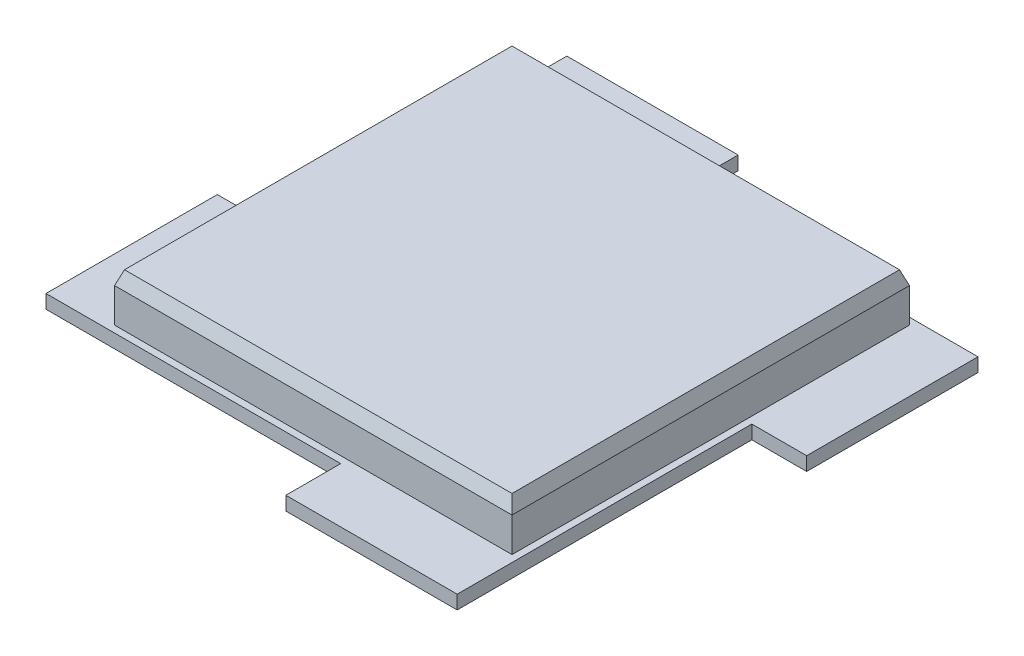
ISO-10303-21;
HEADER;
FILE_DESCRIPTION(('STEP AP214'),'2;1');
FILE_NAME('part.step','',(''),(''),'','','');
FILE_SCHEMA(('AUTOMOTIVE_DESIGN { 1 0 10303 214 1 1 1 1 }'));
ENDSEC;
DATA;
#1=APPLICATION_CONTEXT('core data for automotive mechanical design processes');
#2=APPLICATION_PROTOCOL_DEFINITION('international standard','automotive_design',2000,#1);
#3=PRODUCT_CONTEXT('',#1,'mechanical');
#4=PRODUCT('Part','Part','',(#3));
#5=PRODUCT_RELATED_PRODUCT_CATEGORY('part','',(#4));
#6=PRODUCT_DEFINITION_FORMATION('','',#4);
#7=PRODUCT_DEFINITION_CONTEXT('part definition',#1,'design');
#8=PRODUCT_DEFINITION('design','',#6,#7);
#9=PRODUCT_DEFINITION_SHAPE('','',#8);
#10=(LENGTH_UNIT() NAMED_UNIT(*) SI_UNIT(.MILLI.,.METRE.));
#11=(NAMED_UNIT(*) PLANE_ANGLE_UNIT() SI_UNIT($,.RADIAN.));
#12=(NAMED_UNIT(*) SI_UNIT($,.STERADIAN.) SOLID_ANGLE_UNIT());
#13=UNCERTAINTY_MEASURE_WITH_UNIT(LENGTH_MEASURE(1.E-05),#10,'distance_accuracy_value','');
#14=(GEOMETRIC_REPRESENTATION_CONTEXT(3) GLOBAL_UNCERTAINTY_ASSIGNED_CONTEXT((#13)) GLOBAL_UNIT_ASSIGNED_CONTEXT((#10,
#11,#12)) REPRESENTATION_CONTEXT('',''));
#15=CARTESIAN_POINT('',(0.,0.,0.));
#16=DIRECTION('',(0.,0.,1.));
#17=DIRECTION('',(1.,0.,0.));
#18=AXIS2_PLACEMENT_3D('',#15,#16,#17);
#19=CARTESIAN_POINT('',(0.,2.,0.));
#20=DIRECTION('',(0.,1.,0.));
#21=DIRECTION('',(0.,0.,1.));
#22=AXIS2_PLACEMENT_3D('',#19,#20,#21);
#23=PLANE('',#22);
#24=DIRECTION('',(-1.,0.,0.));
#25=VECTOR('',#24,1.);
#26=CARTESIAN_POINT('',(0.,2.,-8.));
#27=LINE('',#26,#25);
#28=CARTESIAN_POINT('',(43.,2.,-8.));
#29=VERTEX_POINT('',#28);
#30=CARTESIAN_POINT('',(0.,2.,-8.));
#31=VERTEX_POINT('',#30);
#32=EDGE_CURVE('E192',#29,#31,#27,.T.);
#33=ORIENTED_EDGE('',*,*,#32,.F.);
#34=DIRECTION('',(0.,0.,1.));
#35=VECTOR('',#34,1.);
#36=CARTESIAN_POINT('',(43.,2.,0.));
#37=LINE('',#36,#35);
#38=CARTESIAN_POINT('',(43.,2.,0.));
#39=VERTEX_POINT('',#38);
#40=EDGE_CURVE('E259',#29,#39,#37,.T.);
#41=ORIENTED_EDGE('',*,*,#40,.T.);
#42=DIRECTION('',(1.,0.,0.));
#43=VECTOR('',#42,1.);
#44=CARTESIAN_POINT('',(0.,2.,0.));
#45=LINE('',#44,#43);
#46=CARTESIAN_POINT('',(68.,2.,0.));
#47=VERTEX_POINT('',#46);
#48=EDGE_CURVE('E220',#39,#47,#45,.T.);
#49=ORIENTED_EDGE('',*,*,#48,.T.);
#50=DIRECTION('',(0.,0.,-1.));
#51=VECTOR('',#50,1.);
#52=CARTESIAN_POINT('',(68.,2.,0.));
#53=LINE('',#52,#51);
#54=CARTESIAN_POINT('',(68.,2.,-43.));
#55=VERTEX_POINT('',#54);
#56=EDGE_CURVE('E239',#47,#55,#53,.T.);
#57=ORIENTED_EDGE('',*,*,#56,.T.);
#58=DIRECTION('',(1.,0.,0.));
#59=VECTOR('',#58,1.);
#60=CARTESIAN_POINT('',(0.,2.,-43.));
#61=LINE('',#60,#59);
#62=CARTESIAN_POINT('',(76.,2.,-43.));
#63=VERTEX_POINT('',#62);
#64=EDGE_CURVE('E236',#55,#63,#61,.T.);
#65=ORIENTED_EDGE('',*,*,#64,.T.);
#66=DIRECTION('',(0.,0.,-1.));
#67=VECTOR('',#66,1.);
#68=CARTESIAN_POINT('',(76.,2.,0.));
#69=LINE('',#68,#67);
#70=CARTESIAN_POINT('',(76.,2.,-68.));
#71=VERTEX_POINT('',#70);
#72=EDGE_CURVE('E238',#63,#71,#69,.T.);
#73=ORIENTED_EDGE('',*,*,#72,.T.);
#74=DIRECTION('',(-1.,0.,0.));
#75=VECTOR('',#74,1.);
#76=CARTESIAN_POINT('',(0.,2.,-68.));
#77=LINE('',#76,#75);
#78=CARTESIAN_POINT('',(33.,2.,-68.));
#79=VERTEX_POINT('',#78);
#80=EDGE_CURVE('E241',#71,#79,#77,.T.);
#81=ORIENTED_EDGE('',*,*,#80,.T.);
#82=DIRECTION('',(0.,0.,-1.));
#83=VECTOR('',#82,1.);
#84=CARTESIAN_POINT('',(33.,2.,0.));
#85=LINE('',#84,#83);
#86=CARTESIAN_POINT('',(33.,2.,-76.));
#87=VERTEX_POINT('',#86);
#88=EDGE_CURVE('E247',#79,#87,#85,.T.);
#89=ORIENTED_EDGE('',*,*,#88,.T.);
#90=DIRECTION('',(-1.,0.,0.));
#91=VECTOR('',#90,1.);
#92=CARTESIAN_POINT('',(0.,2.,-76.));
#93=LINE('',#92,#91);
#94=CARTESIAN_POINT('',(8.,2.,-76.));
#95=VERTEX_POINT('',#94);
#96=EDGE_CURVE('E145',#87,#95,#93,.T.);
#97=ORIENTED_EDGE('',*,*,#96,.T.);
#98=DIRECTION('',(0.,0.,1.));
#99=VECTOR('',#98,1.);
#100=CARTESIAN_POINT('',(8.00000000000001,2.,0.));
#101=LINE('',#100,#99);
#102=CARTESIAN_POINT('',(8.00000000000001,2.,-33.));
#103=VERTEX_POINT('',#102);
#104=EDGE_CURVE('E136',#95,#103,#101,.T.);
#105=ORIENTED_EDGE('',*,*,#104,.T.);
#106=DIRECTION('',(-1.,0.,0.));
#107=VECTOR('',#106,1.);
#108=CARTESIAN_POINT('',(0.,2.,-33.));
#109=LINE('',#108,#107);
#110=CARTESIAN_POINT('',(0.,2.,-33.));
#111=VERTEX_POINT('',#110);
#112=EDGE_CURVE('E142',#103,#111,#109,.T.);
#113=ORIENTED_EDGE('',*,*,#112,.T.);
#114=DIRECTION('',(0.,0.,-1.));
#115=VECTOR('',#114,1.);
#116=CARTESIAN_POINT('',(0.,2.,0.));
#117=LINE('',#116,#115);
#118=EDGE_CURVE('E162',#31,#111,#117,.T.);
#119=ORIENTED_EDGE('',*,*,#118,.F.);
#120=EDGE_LOOP('',(#33,#41,#49,#57,#65,#73,#81,#89,#97,#105,#113,#119));
#121=FACE_BOUND('',#120,.T.);
#122=DIRECTION('',(0.,0.,1.));
#123=VECTOR('',#122,1.);
#124=CARTESIAN_POINT('',(9.,2.,-67.));
#125=LINE('',#124,#123);
#126=CARTESIAN_POINT('',(9.,2.,-67.));
#127=VERTEX_POINT('',#126);
#128=CARTESIAN_POINT('',(9.00000000000001,2.,-9.));
#129=VERTEX_POINT('',#128);
#130=EDGE_CURVE('E278',#127,#129,#125,.T.);
#131=ORIENTED_EDGE('',*,*,#130,.F.);
#132=DIRECTION('',(-1.,0.,0.));
#133=VECTOR('',#132,1.);
#134=CARTESIAN_POINT('',(67.,2.,-67.));
#135=LINE('',#134,#133);
#136=CARTESIAN_POINT('',(67.,2.,-67.));
#137=VERTEX_POINT('',#136);
#138=EDGE_CURVE('E281',#137,#127,#135,.T.);
#139=ORIENTED_EDGE('',*,*,#138,.F.);
#140=DIRECTION('',(0.,0.,-1.));
#141=VECTOR('',#140,1.);
#142=CARTESIAN_POINT('',(67.,2.,-67.));
#143=LINE('',#142,#141);
#144=CARTESIAN_POINT('',(67.,2.,-9.));
#145=VERTEX_POINT('',#144);
#146=EDGE_CURVE('E273',#145,#137,#143,.T.);
#147=ORIENTED_EDGE('',*,*,#146,.F.);
#148=DIRECTION('',(1.,0.,0.));
#149=VECTOR('',#148,1.);
#150=CARTESIAN_POINT('',(9.00000000000001,2.,-9.));
#151=LINE('',#150,#149);
#152=EDGE_CURVE('E276',#129,#145,#151,.T.);
#153=ORIENTED_EDGE('',*,*,#152,.F.);
#154=EDGE_LOOP('',(#131,#139,#147,#153));
#155=FACE_BOUND('',#154,.T.);
#156=ADVANCED_FACE('F35',(#121,#155),#23,.T.);
#157=CARTESIAN_POINT('',(0.,2.,-8.));
#158=DIRECTION('',(0.,0.,1.));
#159=DIRECTION('',(1.,0.,0.));
#160=AXIS2_PLACEMENT_3D('',#157,#158,#159);
#161=PLANE('',#160);
#162=DIRECTION('',(-1.,0.,0.));
#163=VECTOR('',#162,1.);
#164=CARTESIAN_POINT('',(0.,0.,-8.));
#165=LINE('',#164,#163);
#166=CARTESIAN_POINT('',(43.,0.,-8.));
#167=VERTEX_POINT('',#166);
#168=CARTESIAN_POINT('',(0.,0.,-8.));
#169=VERTEX_POINT('',#168);
#170=EDGE_CURVE('E167',#167,#169,#165,.T.);
#171=ORIENTED_EDGE('',*,*,#170,.F.);
#172=DIRECTION('',(0.,-1.,0.));
#173=VECTOR('',#172,1.);
#174=CARTESIAN_POINT('',(43.,2.,-8.));
#175=LINE('',#174,#173);
#176=EDGE_CURVE('E11',#29,#167,#175,.T.);
#177=ORIENTED_EDGE('',*,*,#176,.F.);
#178=ORIENTED_EDGE('',*,*,#32,.T.);
#179=DIRECTION('',(0.,-1.,0.));
#180=VECTOR('',#179,1.);
#181=CARTESIAN_POINT('',(0.,2.,-8.));
#182=LINE('',#181,#180);
#183=EDGE_CURVE('E59',#31,#169,#182,.T.);
#184=ORIENTED_EDGE('',*,*,#183,.T.);
#185=EDGE_LOOP('',(#171,#177,#178,#184));
#186=FACE_BOUND('',#185,.T.);
#187=ADVANCED_FACE('F37',(#186),#161,.T.);
#188=CARTESIAN_POINT('',(43.,2.,0.));
#189=DIRECTION('',(1.,0.,0.));
#190=DIRECTION('',(0.,0.,-1.));
#191=AXIS2_PLACEMENT_3D('',#188,#189,#190);
#192=PLANE('',#191);
#193=DIRECTION('',(0.,0.,1.));
#194=VECTOR('',#193,1.);
#195=CARTESIAN_POINT('',(43.,0.,0.));
#196=LINE('',#195,#194);
#197=CARTESIAN_POINT('',(43.,0.,0.));
#198=VERTEX_POINT('',#197);
#199=EDGE_CURVE('E169',#167,#198,#196,.T.);
#200=ORIENTED_EDGE('',*,*,#199,.T.);
#201=DIRECTION('',(0.,-1.,0.));
#202=VECTOR('',#201,1.);
#203=CARTESIAN_POINT('',(43.,2.,0.));
#204=LINE('',#203,#202);
#205=EDGE_CURVE('E43',#39,#198,#204,.T.);
#206=ORIENTED_EDGE('',*,*,#205,.F.);
#207=ORIENTED_EDGE('',*,*,#40,.F.);
#208=ORIENTED_EDGE('',*,*,#176,.T.);
#209=EDGE_LOOP('',(#200,#206,#207,#208));
#210=FACE_BOUND('',#209,.T.);
#211=ADVANCED_FACE('F376',(#210),#192,.F.);
#212=CARTESIAN_POINT('',(0.,2.,0.));
#213=DIRECTION('',(0.,0.,-1.));
#214=DIRECTION('',(-1.,0.,0.));
#215=AXIS2_PLACEMENT_3D('',#212,#213,#214);
#216=PLANE('',#215);
#217=DIRECTION('',(1.,0.,0.));
#218=VECTOR('',#217,1.);
#219=CARTESIAN_POINT('',(0.,0.,0.));
#220=LINE('',#219,#218);
#221=CARTESIAN_POINT('',(68.,0.,0.));
#222=VERTEX_POINT('',#221);
#223=EDGE_CURVE('E172',#198,#222,#220,.T.);
#224=ORIENTED_EDGE('',*,*,#223,.T.);
#225=DIRECTION('',(0.,-1.,0.));
#226=VECTOR('',#225,1.);
#227=CARTESIAN_POINT('',(68.,2.,0.));
#228=LINE('',#227,#226);
#229=EDGE_CURVE('E211',#47,#222,#228,.T.);
#230=ORIENTED_EDGE('',*,*,#229,.F.);
#231=ORIENTED_EDGE('',*,*,#48,.F.);
#232=ORIENTED_EDGE('',*,*,#205,.T.);
#233=EDGE_LOOP('',(#224,#230,#231,#232));
#234=FACE_BOUND('',#233,.T.);
#235=ADVANCED_FACE('F218',(#234),#216,.F.);
#236=CARTESIAN_POINT('',(68.,2.,0.));
#237=DIRECTION('',(-1.,0.,0.));
#238=DIRECTION('',(0.,0.,1.));
#239=AXIS2_PLACEMENT_3D('',#236,#237,#238);
#240=PLANE('',#239);
#241=DIRECTION('',(0.,0.,-1.));
#242=VECTOR('',#241,1.);
#243=CARTESIAN_POINT('',(68.,0.,0.));
#244=LINE('',#243,#242);
#245=CARTESIAN_POINT('',(68.,0.,-43.));
#246=VERTEX_POINT('',#245);
#247=EDGE_CURVE('E174',#222,#246,#244,.T.);
#248=ORIENTED_EDGE('',*,*,#247,.T.);
#249=DIRECTION('',(0.,-1.,0.));
#250=VECTOR('',#249,1.);
#251=CARTESIAN_POINT('',(68.,2.,-43.));
#252=LINE('',#251,#250);
#253=EDGE_CURVE('E208',#55,#246,#252,.T.);
#254=ORIENTED_EDGE('',*,*,#253,.F.);
#255=ORIENTED_EDGE('',*,*,#56,.F.);
#256=ORIENTED_EDGE('',*,*,#229,.T.);
#257=EDGE_LOOP('',(#248,#254,#255,#256));
#258=FACE_BOUND('',#257,.T.);
#259=ADVANCED_FACE('F230',(#258),#240,.F.);
#260=CARTESIAN_POINT('',(0.,2.,-43.));
#261=DIRECTION('',(0.,0.,-1.));
#262=DIRECTION('',(-1.,0.,0.));
#263=AXIS2_PLACEMENT_3D('',#260,#261,#262);
#264=PLANE('',#263);
#265=DIRECTION('',(1.,0.,0.));
#266=VECTOR('',#265,1.);
#267=CARTESIAN_POINT('',(0.,0.,-43.));
#268=LINE('',#267,#266);
#269=CARTESIAN_POINT('',(76.,0.,-43.));
#270=VERTEX_POINT('',#269);
#271=EDGE_CURVE('E176',#246,#270,#268,.T.);
#272=ORIENTED_EDGE('',*,*,#271,.T.);
#273=DIRECTION('',(0.,-1.,0.));
#274=VECTOR('',#273,1.);
#275=CARTESIAN_POINT('',(76.,2.,-43.));
#276=LINE('',#275,#274);
#277=EDGE_CURVE('E205',#63,#270,#276,.T.);
#278=ORIENTED_EDGE('',*,*,#277,.F.);
#279=ORIENTED_EDGE('',*,*,#64,.F.);
#280=ORIENTED_EDGE('',*,*,#253,.T.);
#281=EDGE_LOOP('',(#272,#278,#279,#280));
#282=FACE_BOUND('',#281,.T.);
#283=ADVANCED_FACE('F234',(#282),#264,.F.);
#284=CARTESIAN_POINT('',(76.,2.,0.));
#285=DIRECTION('',(-1.,0.,0.));
#286=DIRECTION('',(0.,0.,1.));
#287=AXIS2_PLACEMENT_3D('',#284,#285,#286);
#288=PLANE('',#287);
#289=DIRECTION('',(0.,0.,-1.));
#290=VECTOR('',#289,1.);
#291=CARTESIAN_POINT('',(76.,0.,0.));
#292=LINE('',#291,#290);
#293=CARTESIAN_POINT('',(76.,0.,-68.));
#294=VERTEX_POINT('',#293);
#295=EDGE_CURVE('E178',#270,#294,#292,.T.);
#296=ORIENTED_EDGE('',*,*,#295,.T.);
#297=DIRECTION('',(0.,-1.,0.));
#298=VECTOR('',#297,1.);
#299=CARTESIAN_POINT('',(76.,2.,-68.));
#300=LINE('',#299,#298);
#301=EDGE_CURVE('E202',#71,#294,#300,.T.);
#302=ORIENTED_EDGE('',*,*,#301,.F.);
#303=ORIENTED_EDGE('',*,*,#72,.F.);
#304=ORIENTED_EDGE('',*,*,#277,.T.);
#305=EDGE_LOOP('',(#296,#302,#303,#304));
#306=FACE_BOUND('',#305,.T.);
#307=ADVANCED_FACE('F394',(#306),#288,.F.);
#308=CARTESIAN_POINT('',(0.,2.,-68.));
#309=DIRECTION('',(0.,0.,1.));
#310=DIRECTION('',(1.,0.,0.));
#311=AXIS2_PLACEMENT_3D('',#308,#309,#310);
#312=PLANE('',#311);
#313=DIRECTION('',(-1.,0.,0.));
#314=VECTOR('',#313,1.);
#315=CARTESIAN_POINT('',(0.,0.,-68.));
#316=LINE('',#315,#314);
#317=CARTESIAN_POINT('',(33.,0.,-68.));
#318=VERTEX_POINT('',#317);
#319=EDGE_CURVE('E180',#294,#318,#316,.T.);
#320=ORIENTED_EDGE('',*,*,#319,.T.);
#321=DIRECTION('',(0.,-1.,0.));
#322=VECTOR('',#321,1.);
#323=CARTESIAN_POINT('',(33.,2.,-68.));
#324=LINE('',#323,#322);
#325=EDGE_CURVE('E199',#79,#318,#324,.T.);
#326=ORIENTED_EDGE('',*,*,#325,.F.);
#327=ORIENTED_EDGE('',*,*,#80,.F.);
#328=ORIENTED_EDGE('',*,*,#301,.T.);
#329=EDGE_LOOP('',(#320,#326,#327,#328));
#330=FACE_BOUND('',#329,.T.);
#331=ADVANCED_FACE('F391',(#330),#312,.F.);
#332=CARTESIAN_POINT('',(33.,2.,0.));
#333=DIRECTION('',(-1.,0.,0.));
#334=DIRECTION('',(0.,0.,1.));
#335=AXIS2_PLACEMENT_3D('',#332,#333,#334);
#336=PLANE('',#335);
#337=DIRECTION('',(0.,0.,-1.));
#338=VECTOR('',#337,1.);
#339=CARTESIAN_POINT('',(33.,0.,0.));
#340=LINE('',#339,#338);
#341=CARTESIAN_POINT('',(33.,0.,-76.));
#342=VERTEX_POINT('',#341);
#343=EDGE_CURVE('E182',#318,#342,#340,.T.);
#344=ORIENTED_EDGE('',*,*,#343,.T.);
#345=DIRECTION('',(0.,-1.,0.));
#346=VECTOR('',#345,1.);
#347=CARTESIAN_POINT('',(33.,2.,-76.));
#348=LINE('',#347,#346);
#349=EDGE_CURVE('E196',#87,#342,#348,.T.);
#350=ORIENTED_EDGE('',*,*,#349,.F.);
#351=ORIENTED_EDGE('',*,*,#88,.F.);
#352=ORIENTED_EDGE('',*,*,#325,.T.);
#353=EDGE_LOOP('',(#344,#350,#351,#352));
#354=FACE_BOUND('',#353,.T.);
#355=ADVANCED_FACE('F253',(#354),#336,.F.);
#356=CARTESIAN_POINT('',(0.,2.,-76.));
#357=DIRECTION('',(0.,0.,1.));
#358=DIRECTION('',(1.,0.,0.));
#359=AXIS2_PLACEMENT_3D('',#356,#357,#358);
#360=PLANE('',#359);
#361=DIRECTION('',(-1.,0.,0.));
#362=VECTOR('',#361,1.);
#363=CARTESIAN_POINT('',(0.,0.,-76.));
#364=LINE('',#363,#362);
#365=CARTESIAN_POINT('',(8.,0.,-76.));
#366=VERTEX_POINT('',#365);
#367=EDGE_CURVE('E184',#342,#366,#364,.T.);
#368=ORIENTED_EDGE('',*,*,#367,.T.);
#369=DIRECTION('',(0.,-1.,0.));
#370=VECTOR('',#369,1.);
#371=CARTESIAN_POINT('',(8.,2.,-76.));
#372=LINE('',#371,#370);
#373=EDGE_CURVE('E158',#95,#366,#372,.T.);
#374=ORIENTED_EDGE('',*,*,#373,.F.);
#375=ORIENTED_EDGE('',*,*,#96,.F.);
#376=ORIENTED_EDGE('',*,*,#349,.T.);
#377=EDGE_LOOP('',(#368,#374,#375,#376));
#378=FACE_BOUND('',#377,.T.);
#379=ADVANCED_FACE('F257',(#378),#360,.F.);
#380=CARTESIAN_POINT('',(8.00000000000001,2.,0.));
#381=DIRECTION('',(1.,0.,0.));
#382=DIRECTION('',(0.,0.,-1.));
#383=AXIS2_PLACEMENT_3D('',#380,#381,#382);
#384=PLANE('',#383);
#385=DIRECTION('',(0.,0.,1.));
#386=VECTOR('',#385,1.);
#387=CARTESIAN_POINT('',(8.00000000000001,0.,0.));
#388=LINE('',#387,#386);
#389=CARTESIAN_POINT('',(8.00000000000001,0.,-33.));
#390=VERTEX_POINT('',#389);
#391=EDGE_CURVE('E154',#366,#390,#388,.T.);
#392=ORIENTED_EDGE('',*,*,#391,.T.);
#393=DIRECTION('',(0.,-1.,0.));
#394=VECTOR('',#393,1.);
#395=CARTESIAN_POINT('',(8.00000000000001,2.,-33.));
#396=LINE('',#395,#394);
#397=EDGE_CURVE('E151',#103,#390,#396,.T.);
#398=ORIENTED_EDGE('',*,*,#397,.F.);
#399=ORIENTED_EDGE('',*,*,#104,.F.);
#400=ORIENTED_EDGE('',*,*,#373,.T.);
#401=EDGE_LOOP('',(#392,#398,#399,#400));
#402=FACE_BOUND('',#401,.T.);
#403=ADVANCED_FACE('F152',(#402),#384,.F.);
#404=CARTESIAN_POINT('',(0.,2.,-33.));
#405=DIRECTION('',(0.,0.,1.));
#406=DIRECTION('',(1.,0.,0.));
#407=AXIS2_PLACEMENT_3D('',#404,#405,#406);
#408=PLANE('',#407);
#409=DIRECTION('',(-1.,0.,0.));
#410=VECTOR('',#409,1.);
#411=CARTESIAN_POINT('',(0.,0.,-33.));
#412=LINE('',#411,#410);
#413=CARTESIAN_POINT('',(0.,0.,-33.));
#414=VERTEX_POINT('',#413);
#415=EDGE_CURVE('E187',#390,#414,#412,.T.);
#416=ORIENTED_EDGE('',*,*,#415,.T.);
#417=DIRECTION('',(0.,-1.,0.));
#418=VECTOR('',#417,1.);
#419=CARTESIAN_POINT('',(0.,2.,-33.));
#420=LINE('',#419,#418);
#421=EDGE_CURVE('E159',#111,#414,#420,.T.);
#422=ORIENTED_EDGE('',*,*,#421,.F.);
#423=ORIENTED_EDGE('',*,*,#112,.F.);
#424=ORIENTED_EDGE('',*,*,#397,.T.);
#425=EDGE_LOOP('',(#416,#422,#423,#424));
#426=FACE_BOUND('',#425,.T.);
#427=ADVANCED_FACE('F161',(#426),#408,.F.);
#428=CARTESIAN_POINT('',(0.,2.,0.));
#429=DIRECTION('',(-1.,0.,0.));
#430=DIRECTION('',(0.,0.,1.));
#431=AXIS2_PLACEMENT_3D('',#428,#429,#430);
#432=PLANE('',#431);
#433=DIRECTION('',(0.,0.,-1.));
#434=VECTOR('',#433,1.);
#435=CARTESIAN_POINT('',(0.,0.,0.));
#436=LINE('',#435,#434);
#437=EDGE_CURVE('E189',#169,#414,#436,.T.);
#438=ORIENTED_EDGE('',*,*,#437,.F.);
#439=ORIENTED_EDGE('',*,*,#183,.F.);
#440=ORIENTED_EDGE('',*,*,#118,.T.);
#441=ORIENTED_EDGE('',*,*,#421,.T.);
#442=EDGE_LOOP('',(#438,#439,#440,#441));
#443=FACE_BOUND('',#442,.T.);
#444=ADVANCED_FACE('F258',(#443),#432,.T.);
#445=CARTESIAN_POINT('',(0.,0.,0.));
#446=DIRECTION('',(0.,1.,0.));
#447=DIRECTION('',(0.,0.,1.));
#448=AXIS2_PLACEMENT_3D('',#445,#446,#447);
#449=PLANE('',#448);
#450=ORIENTED_EDGE('',*,*,#170,.T.);
#451=ORIENTED_EDGE('',*,*,#437,.T.);
#452=ORIENTED_EDGE('',*,*,#415,.F.);
#453=ORIENTED_EDGE('',*,*,#391,.F.);
#454=ORIENTED_EDGE('',*,*,#367,.F.);
#455=ORIENTED_EDGE('',*,*,#343,.F.);
#456=ORIENTED_EDGE('',*,*,#319,.F.);
#457=ORIENTED_EDGE('',*,*,#295,.F.);
#458=ORIENTED_EDGE('',*,*,#271,.F.);
#459=ORIENTED_EDGE('',*,*,#247,.F.);
#460=ORIENTED_EDGE('',*,*,#223,.F.);
#461=ORIENTED_EDGE('',*,*,#199,.F.);
#462=EDGE_LOOP('',(#450,#451,#452,#453,#454,#455,#456,#457,#458,#459,#460,#461));
#463=FACE_BOUND('',#462,.T.);
#464=ADVANCED_FACE('F225',(#463),#449,.F.);
#465=CARTESIAN_POINT('',(67.,7.,-67.));
#466=DIRECTION('',(0.,0.,1.));
#467=DIRECTION('',(1.,0.,0.));
#468=AXIS2_PLACEMENT_3D('',#465,#466,#467);
#469=PLANE('',#468);
#470=ORIENTED_EDGE('',*,*,#138,.T.);
#471=DIRECTION('',(0.,-1.,0.));
#472=VECTOR('',#471,1.);
#473=CARTESIAN_POINT('',(9.,7.,-67.));
#474=LINE('',#473,#472);
#475=CARTESIAN_POINT('',(9.,7.,-67.));
#476=VERTEX_POINT('',#475);
#477=EDGE_CURVE('E170',#476,#127,#474,.T.);
#478=ORIENTED_EDGE('',*,*,#477,.F.);
#479=DIRECTION('',(-1.,0.,0.));
#480=VECTOR('',#479,1.);
#481=CARTESIAN_POINT('',(67.,7.,-67.));
#482=LINE('',#481,#480);
#483=CARTESIAN_POINT('',(67.,7.,-67.));
#484=VERTEX_POINT('',#483);
#485=EDGE_CURVE('E275',#484,#476,#482,.T.);
#486=ORIENTED_EDGE('',*,*,#485,.F.);
#487=DIRECTION('',(0.,-1.,0.));
#488=VECTOR('',#487,1.);
#489=CARTESIAN_POINT('',(67.,7.,-67.));
#490=LINE('',#489,#488);
#491=EDGE_CURVE('E269',#484,#137,#490,.T.);
#492=ORIENTED_EDGE('',*,*,#491,.T.);
#493=EDGE_LOOP('',(#470,#478,#486,#492));
#494=FACE_BOUND('',#493,.T.);
#495=ADVANCED_FACE('F340',(#494),#469,.F.);
#496=CARTESIAN_POINT('',(9.,7.,-67.));
#497=DIRECTION('',(1.,0.,0.));
#498=DIRECTION('',(0.,0.,-1.));
#499=AXIS2_PLACEMENT_3D('',#496,#497,#498);
#500=PLANE('',#499);
#501=ORIENTED_EDGE('',*,*,#130,.T.);
#502=DIRECTION('',(0.,-1.,0.));
#503=VECTOR('',#502,1.);
#504=CARTESIAN_POINT('',(9.00000000000001,7.,-9.));
#505=LINE('',#504,#503);
#506=CARTESIAN_POINT('',(9.00000000000001,7.,-9.));
#507=VERTEX_POINT('',#506);
#508=EDGE_CURVE('E265',#507,#129,#505,.T.);
#509=ORIENTED_EDGE('',*,*,#508,.F.);
#510=DIRECTION('',(0.,0.,1.));
#511=VECTOR('',#510,1.);
#512=CARTESIAN_POINT('',(9.,7.,-67.));
#513=LINE('',#512,#511);
#514=EDGE_CURVE('E290',#476,#507,#513,.T.);
#515=ORIENTED_EDGE('',*,*,#514,.F.);
#516=ORIENTED_EDGE('',*,*,#477,.T.);
#517=EDGE_LOOP('',(#501,#509,#515,#516));
#518=FACE_BOUND('',#517,.T.);
#519=ADVANCED_FACE('F335',(#518),#500,.F.);
#520=CARTESIAN_POINT('',(9.00000000000001,7.,-9.));
#521=DIRECTION('',(0.,0.,-1.));
#522=DIRECTION('',(-1.,0.,0.));
#523=AXIS2_PLACEMENT_3D('',#520,#521,#522);
#524=PLANE('',#523);
#525=ORIENTED_EDGE('',*,*,#152,.T.);
#526=DIRECTION('',(0.,-1.,0.));
#527=VECTOR('',#526,1.);
#528=CARTESIAN_POINT('',(67.,7.,-9.));
#529=LINE('',#528,#527);
#530=CARTESIAN_POINT('',(67.,7.,-9.));
#531=VERTEX_POINT('',#530);
#532=EDGE_CURVE('E50',#531,#145,#529,.T.);
#533=ORIENTED_EDGE('',*,*,#532,.F.);
#534=DIRECTION('',(1.,0.,0.));
#535=VECTOR('',#534,1.);
#536=CARTESIAN_POINT('',(9.00000000000001,7.,-9.));
#537=LINE('',#536,#535);
#538=EDGE_CURVE('E287',#507,#531,#537,.T.);
#539=ORIENTED_EDGE('',*,*,#538,.F.);
#540=ORIENTED_EDGE('',*,*,#508,.T.);
#541=EDGE_LOOP('',(#525,#533,#539,#540));
#542=FACE_BOUND('',#541,.T.);
#543=ADVANCED_FACE('F362',(#542),#524,.F.);
#544=CARTESIAN_POINT('',(67.,7.,-67.));
#545=DIRECTION('',(-1.,0.,0.));
#546=DIRECTION('',(0.,0.,1.));
#547=AXIS2_PLACEMENT_3D('',#544,#545,#546);
#548=PLANE('',#547);
#549=ORIENTED_EDGE('',*,*,#146,.T.);
#550=ORIENTED_EDGE('',*,*,#491,.F.);
#551=DIRECTION('',(0.,0.,-1.));
#552=VECTOR('',#551,1.);
#553=CARTESIAN_POINT('',(67.,7.,-67.));
#554=LINE('',#553,#552);
#555=EDGE_CURVE('E272',#531,#484,#554,.T.);
#556=ORIENTED_EDGE('',*,*,#555,.F.);
#557=ORIENTED_EDGE('',*,*,#532,.T.);
#558=EDGE_LOOP('',(#549,#550,#556,#557));
#559=FACE_BOUND('',#558,.T.);
#560=ADVANCED_FACE('F355',(#559),#548,.F.);
#561=CARTESIAN_POINT('',(9.00000000000001,7.,0.));
#562=DIRECTION('',(-0.939692620785908,0.342020143325669,0.));
#563=DIRECTION('',(-0.342020143325669,-0.939692620785908,0.));
#564=AXIS2_PLACEMENT_3D('',#561,#562,#563);
#565=PLANE('',#564);
#566=ORIENTED_EDGE('',*,*,#514,.T.);
#567=DIRECTION('',(-0.323615577118185,-0.889126490715988,0.323615577118185));
#568=VECTOR('',#567,1.);
#569=CARTESIAN_POINT('',(8.05745662421818,4.41038335818291,-8.05745662421817));
#570=LINE('',#569,#568);
#571=CARTESIAN_POINT('',(9.72794046853241,9.,-9.72794046853241));
#572=VERTEX_POINT('',#571);
#573=EDGE_CURVE('E284',#572,#507,#570,.T.);
#574=ORIENTED_EDGE('',*,*,#573,.F.);
#575=DIRECTION('',(0.,0.,-1.));
#576=VECTOR('',#575,1.);
#577=CARTESIAN_POINT('',(9.72794046853242,9.,0.));
#578=LINE('',#577,#576);
#579=CARTESIAN_POINT('',(9.72794046853241,9.,-66.2720595314676));
#580=VERTEX_POINT('',#579);
#581=EDGE_CURVE('E305',#580,#572,#578,.F.);
#582=ORIENTED_EDGE('',*,*,#581,.F.);
#583=DIRECTION('',(-0.323615577118185,-0.889126490715988,-0.323615577118185));
#584=VECTOR('',#583,1.);
#585=CARTESIAN_POINT('',(16.0167117974869,26.2782572224161,-59.9832882025131));
#586=LINE('',#585,#584);
#587=EDGE_CURVE('E298',#580,#476,#586,.T.);
#588=ORIENTED_EDGE('',*,*,#587,.T.);
#589=EDGE_LOOP('',(#566,#574,#582,#588));
#590=FACE_BOUND('',#589,.T.);
#591=ADVANCED_FACE('F331',(#590),#565,.T.);
#592=CARTESIAN_POINT('',(0.,7.,-9.));
#593=DIRECTION('',(0.,0.342020143325669,0.939692620785908));
#594=DIRECTION('',(0.,-0.939692620785908,0.342020143325669));
#595=AXIS2_PLACEMENT_3D('',#592,#593,#594);
#596=PLANE('',#595);
#597=ORIENTED_EDGE('',*,*,#538,.T.);
#598=DIRECTION('',(-0.323615577118185,0.889126490715988,-0.323615577118185));
#599=VECTOR('',#598,1.);
#600=CARTESIAN_POINT('',(59.9832882025131,26.2782572224161,-16.0167117974869));
#601=LINE('',#600,#599);
#602=CARTESIAN_POINT('',(66.2720595314676,9.,-9.72794046853241));
#603=VERTEX_POINT('',#602);
#604=EDGE_CURVE('E308',#603,#531,#601,.F.);
#605=ORIENTED_EDGE('',*,*,#604,.F.);
#606=DIRECTION('',(-1.,0.,0.));
#607=VECTOR('',#606,1.);
#608=CARTESIAN_POINT('',(0.,9.,-9.72794046853241));
#609=LINE('',#608,#607);
#610=EDGE_CURVE('E302',#572,#603,#609,.F.);
#611=ORIENTED_EDGE('',*,*,#610,.F.);
#612=ORIENTED_EDGE('',*,*,#573,.T.);
#613=EDGE_LOOP('',(#597,#605,#611,#612));
#614=FACE_BOUND('',#613,.T.);
#615=ADVANCED_FACE('F321',(#614),#596,.T.);
#616=CARTESIAN_POINT('',(67.,7.,0.));
#617=DIRECTION('',(0.939692620785908,0.342020143325669,0.));
#618=DIRECTION('',(-0.342020143325669,0.939692620785908,0.));
#619=AXIS2_PLACEMENT_3D('',#616,#617,#618);
#620=PLANE('',#619);
#621=ORIENTED_EDGE('',*,*,#555,.T.);
#622=DIRECTION('',(-0.323615577118185,0.889126490715988,0.323615577118185));
#623=VECTOR('',#622,1.);
#624=CARTESIAN_POINT('',(59.9832882025131,26.2782572224161,-59.9832882025131));
#625=LINE('',#624,#623);
#626=CARTESIAN_POINT('',(66.2720595314676,9.,-66.2720595314676));
#627=VERTEX_POINT('',#626);
#628=EDGE_CURVE('E311',#627,#484,#625,.F.);
#629=ORIENTED_EDGE('',*,*,#628,.F.);
#630=DIRECTION('',(0.,0.,1.));
#631=VECTOR('',#630,1.);
#632=CARTESIAN_POINT('',(66.2720595314676,9.,0.));
#633=LINE('',#632,#631);
#634=EDGE_CURVE('E299',#627,#603,#633,.T.);
#635=ORIENTED_EDGE('',*,*,#634,.T.);
#636=ORIENTED_EDGE('',*,*,#604,.T.);
#637=EDGE_LOOP('',(#621,#629,#635,#636));
#638=FACE_BOUND('',#637,.T.);
#639=ADVANCED_FACE('F354',(#638),#620,.T.);
#640=CARTESIAN_POINT('',(0.,7.,-67.));
#641=DIRECTION('',(0.,0.342020143325669,-0.939692620785908));
#642=DIRECTION('',(0.,0.939692620785908,0.342020143325669));
#643=AXIS2_PLACEMENT_3D('',#640,#641,#642);
#644=PLANE('',#643);
#645=ORIENTED_EDGE('',*,*,#485,.T.);
#646=ORIENTED_EDGE('',*,*,#587,.F.);
#647=DIRECTION('',(1.,0.,0.));
#648=VECTOR('',#647,1.);
#649=CARTESIAN_POINT('',(0.,9.,-66.2720595314676));
#650=LINE('',#649,#648);
#651=EDGE_CURVE('E295',#627,#580,#650,.F.);
#652=ORIENTED_EDGE('',*,*,#651,.F.);
#653=ORIENTED_EDGE('',*,*,#628,.T.);
#654=EDGE_LOOP('',(#645,#646,#652,#653));
#655=FACE_BOUND('',#654,.T.);
#656=ADVANCED_FACE('F346',(#655),#644,.T.);
#657=CARTESIAN_POINT('',(0.,9.,0.));
#658=DIRECTION('',(0.,1.,0.));
#659=DIRECTION('',(0.,0.,1.));
#660=AXIS2_PLACEMENT_3D('',#657,#658,#659);
#661=PLANE('',#660);
#662=ORIENTED_EDGE('',*,*,#581,.T.);
#663=ORIENTED_EDGE('',*,*,#610,.T.);
#664=ORIENTED_EDGE('',*,*,#634,.F.);
#665=ORIENTED_EDGE('',*,*,#651,.T.);
#666=EDGE_LOOP('',(#662,#663,#664,#665));
#667=FACE_BOUND('',#666,.T.);
#668=ADVANCED_FACE('F505',(#667),#661,.T.);
#669=CLOSED_SHELL('',(#156,#187,#211,#235,#259,#283,#307,#331,#355,#379,#403,#427,#444,#464,
#495,#519,#543,#560,#591,#615,#639,#656,#668));
#670=MANIFOLD_SOLID_BREP('B2',#669);
#671=ADVANCED_BREP_SHAPE_REPRESENTATION('',(#18,#670),#14);
#672=SHAPE_DEFINITION_REPRESENTATION(#9,#671);
ENDSEC;
END-ISO-10303-21;
